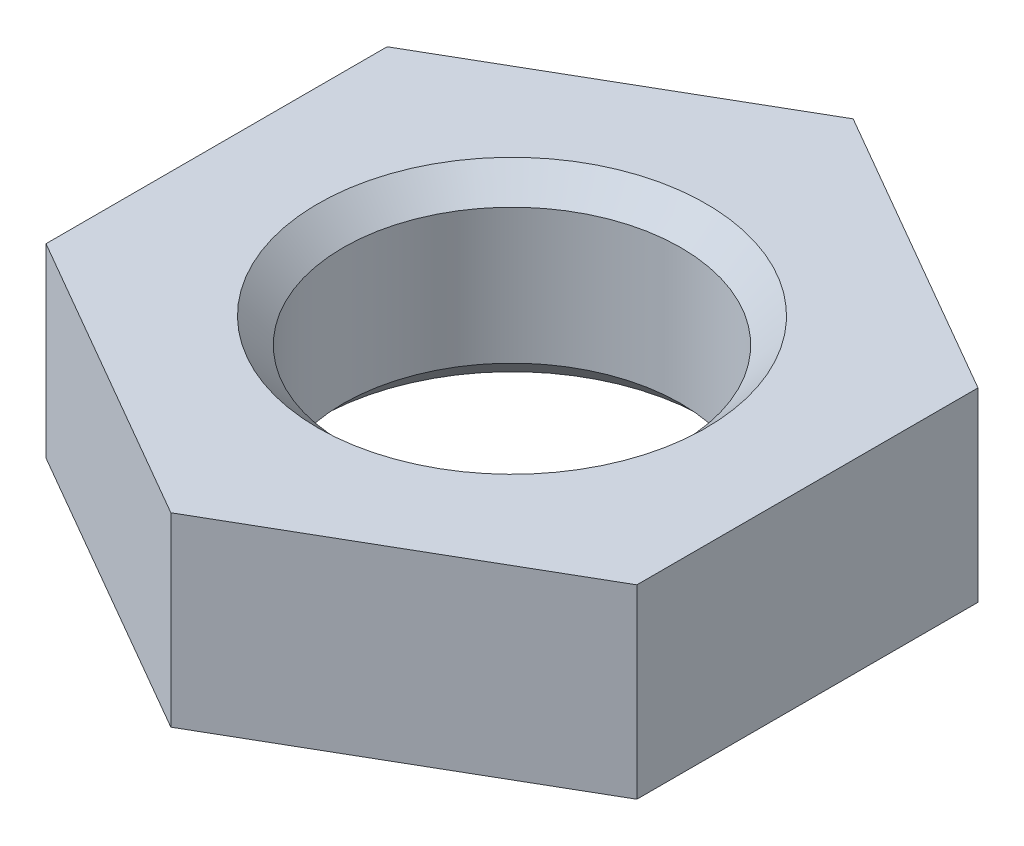
ISO-10303-21;
HEADER;
FILE_DESCRIPTION(('STEP AP214'),'2;1');
FILE_NAME('part.step','',(''),(''),'','','');
FILE_SCHEMA(('AUTOMOTIVE_DESIGN { 1 0 10303 214 1 1 1 1 }'));
ENDSEC;
DATA;
#1=APPLICATION_CONTEXT('core data for automotive mechanical design processes');
#2=APPLICATION_PROTOCOL_DEFINITION('international standard','automotive_design',2000,#1);
#3=PRODUCT_CONTEXT('',#1,'mechanical');
#4=PRODUCT('Part','Part','',(#3));
#5=PRODUCT_RELATED_PRODUCT_CATEGORY('part','',(#4));
#6=PRODUCT_DEFINITION_FORMATION('','',#4);
#7=PRODUCT_DEFINITION_CONTEXT('part definition',#1,'design');
#8=PRODUCT_DEFINITION('design','',#6,#7);
#9=PRODUCT_DEFINITION_SHAPE('','',#8);
#10=(LENGTH_UNIT() NAMED_UNIT(*) SI_UNIT(.MILLI.,.METRE.));
#11=(NAMED_UNIT(*) PLANE_ANGLE_UNIT() SI_UNIT($,.RADIAN.));
#12=(NAMED_UNIT(*) SI_UNIT($,.STERADIAN.) SOLID_ANGLE_UNIT());
#13=UNCERTAINTY_MEASURE_WITH_UNIT(LENGTH_MEASURE(1.E-05),#10,'distance_accuracy_value','');
#14=(GEOMETRIC_REPRESENTATION_CONTEXT(3) GLOBAL_UNCERTAINTY_ASSIGNED_CONTEXT((#13)) GLOBAL_UNIT_ASSIGNED_CONTEXT((#10,
#11,#12)) REPRESENTATION_CONTEXT('',''));
#15=CARTESIAN_POINT('',(0.,0.,0.));
#16=DIRECTION('',(0.,0.,1.));
#17=DIRECTION('',(1.,0.,0.));
#18=AXIS2_PLACEMENT_3D('',#15,#16,#17);
#19=CARTESIAN_POINT('',(0.,2.2,0.));
#20=DIRECTION('',(0.,1.,0.));
#21=DIRECTION('',(0.,0.,1.));
#22=AXIS2_PLACEMENT_3D('',#19,#20,#21);
#23=PLANE('',#22);
#24=CARTESIAN_POINT('',(0.,2.2,0.));
#25=DIRECTION('',(0.,1.,0.));
#26=DIRECTION('',(0.,0.,1.));
#27=AXIS2_PLACEMENT_3D('',#24,#25,#26);
#28=CIRCLE('',#27,2.3);
#29=CARTESIAN_POINT('',(0.,2.2,2.3));
#30=VERTEX_POINT('',#29);
#31=EDGE_CURVE('E11',#30,#30,#28,.F.);
#32=ORIENTED_EDGE('',*,*,#31,.T.);
#33=EDGE_LOOP('',(#32));
#34=FACE_BOUND('',#33,.T.);
#35=DIRECTION('',(-0.866025403784436,0.,0.500000000000004));
#36=VECTOR('',#35,1.);
#37=CARTESIAN_POINT('',(0.,2.2,-4.04145188432738));
#38=LINE('',#37,#36);
#39=CARTESIAN_POINT('',(0.,2.2,-4.04145188432738));
#40=VERTEX_POINT('',#39);
#41=CARTESIAN_POINT('',(-3.50000000000001,2.2,-2.02072594216367));
#42=VERTEX_POINT('',#41);
#43=EDGE_CURVE('E129',#40,#42,#38,.T.);
#44=ORIENTED_EDGE('',*,*,#43,.T.);
#45=DIRECTION('',(0.,0.,1.));
#46=VECTOR('',#45,1.);
#47=CARTESIAN_POINT('',(-3.50000000000001,2.2,-2.02072594216367));
#48=LINE('',#47,#46);
#49=CARTESIAN_POINT('',(-3.49999999999999,2.2,2.02072594216371));
#50=VERTEX_POINT('',#49);
#51=EDGE_CURVE('E89',#42,#50,#48,.T.);
#52=ORIENTED_EDGE('',*,*,#51,.T.);
#53=DIRECTION('',(0.866025403784441,0.,0.499999999999996));
#54=VECTOR('',#53,1.);
#55=CARTESIAN_POINT('',(-3.49999999999999,2.2,2.02072594216371));
#56=LINE('',#55,#54);
#57=CARTESIAN_POINT('',(0.,2.2,4.04145188432738));
#58=VERTEX_POINT('',#57);
#59=EDGE_CURVE('E101',#50,#58,#56,.T.);
#60=ORIENTED_EDGE('',*,*,#59,.T.);
#61=DIRECTION('',(0.866025403784436,0.,-0.500000000000004));
#62=VECTOR('',#61,1.);
#63=CARTESIAN_POINT('',(0.,2.2,4.04145188432738));
#64=LINE('',#63,#62);
#65=CARTESIAN_POINT('',(3.5,2.2,2.02072594216368));
#66=VERTEX_POINT('',#65);
#67=EDGE_CURVE('E96',#58,#66,#64,.T.);
#68=ORIENTED_EDGE('',*,*,#67,.T.);
#69=DIRECTION('',(0.,0.,-1.));
#70=VECTOR('',#69,1.);
#71=CARTESIAN_POINT('',(3.5,2.2,2.02072594216368));
#72=LINE('',#71,#70);
#73=CARTESIAN_POINT('',(3.49999999999999,2.2,-2.02072594216371));
#74=VERTEX_POINT('',#73);
#75=EDGE_CURVE('E99',#66,#74,#72,.T.);
#76=ORIENTED_EDGE('',*,*,#75,.T.);
#77=DIRECTION('',(-0.866025403784441,0.,-0.499999999999996));
#78=VECTOR('',#77,1.);
#79=CARTESIAN_POINT('',(3.49999999999999,2.2,-2.02072594216371));
#80=LINE('',#79,#78);
#81=EDGE_CURVE('E51',#74,#40,#80,.T.);
#82=ORIENTED_EDGE('',*,*,#81,.T.);
#83=EDGE_LOOP('',(#44,#52,#60,#68,#76,#82));
#84=FACE_BOUND('',#83,.T.);
#85=ADVANCED_FACE('F34',(#34,#84),#23,.T.);
#86=CARTESIAN_POINT('',(0.,0.,0.));
#87=DIRECTION('',(0.,1.,0.));
#88=DIRECTION('',(0.,0.,1.));
#89=AXIS2_PLACEMENT_3D('',#86,#87,#88);
#90=PLANE('',#89);
#91=CARTESIAN_POINT('',(0.,0.,0.));
#92=DIRECTION('',(0.,1.,0.));
#93=DIRECTION('',(0.,0.,1.));
#94=AXIS2_PLACEMENT_3D('',#91,#92,#93);
#95=CIRCLE('',#94,2.3);
#96=CARTESIAN_POINT('',(0.,0.,2.3));
#97=VERTEX_POINT('',#96);
#98=EDGE_CURVE('E138',#97,#97,#95,.T.);
#99=ORIENTED_EDGE('',*,*,#98,.T.);
#100=EDGE_LOOP('',(#99));
#101=FACE_BOUND('',#100,.T.);
#102=DIRECTION('',(-0.866025403784436,0.,0.500000000000004));
#103=VECTOR('',#102,1.);
#104=CARTESIAN_POINT('',(0.,0.,-4.04145188432738));
#105=LINE('',#104,#103);
#106=CARTESIAN_POINT('',(0.,0.,-4.04145188432738));
#107=VERTEX_POINT('',#106);
#108=CARTESIAN_POINT('',(-3.50000000000001,0.,-2.02072594216367));
#109=VERTEX_POINT('',#108);
#110=EDGE_CURVE('E119',#107,#109,#105,.T.);
#111=ORIENTED_EDGE('',*,*,#110,.F.);
#112=DIRECTION('',(-0.866025403784441,0.,-0.499999999999996));
#113=VECTOR('',#112,1.);
#114=CARTESIAN_POINT('',(3.49999999999999,0.,-2.02072594216371));
#115=LINE('',#114,#113);
#116=CARTESIAN_POINT('',(3.49999999999999,0.,-2.02072594216371));
#117=VERTEX_POINT('',#116);
#118=EDGE_CURVE('E80',#117,#107,#115,.T.);
#119=ORIENTED_EDGE('',*,*,#118,.F.);
#120=DIRECTION('',(0.,0.,-1.));
#121=VECTOR('',#120,1.);
#122=CARTESIAN_POINT('',(3.5,0.,2.02072594216368));
#123=LINE('',#122,#121);
#124=CARTESIAN_POINT('',(3.5,0.,2.02072594216368));
#125=VERTEX_POINT('',#124);
#126=EDGE_CURVE('E74',#125,#117,#123,.T.);
#127=ORIENTED_EDGE('',*,*,#126,.F.);
#128=DIRECTION('',(0.866025403784436,0.,-0.500000000000004));
#129=VECTOR('',#128,1.);
#130=CARTESIAN_POINT('',(0.,0.,4.04145188432738));
#131=LINE('',#130,#129);
#132=CARTESIAN_POINT('',(0.,0.,4.04145188432738));
#133=VERTEX_POINT('',#132);
#134=EDGE_CURVE('E109',#133,#125,#131,.T.);
#135=ORIENTED_EDGE('',*,*,#134,.F.);
#136=DIRECTION('',(0.866025403784441,0.,0.499999999999996));
#137=VECTOR('',#136,1.);
#138=CARTESIAN_POINT('',(-3.49999999999999,0.,2.02072594216371));
#139=LINE('',#138,#137);
#140=CARTESIAN_POINT('',(-3.49999999999999,0.,2.02072594216371));
#141=VERTEX_POINT('',#140);
#142=EDGE_CURVE('E124',#141,#133,#139,.T.);
#143=ORIENTED_EDGE('',*,*,#142,.F.);
#144=DIRECTION('',(0.,0.,1.));
#145=VECTOR('',#144,1.);
#146=CARTESIAN_POINT('',(-3.50000000000001,0.,-2.02072594216367));
#147=LINE('',#146,#145);
#148=EDGE_CURVE('E122',#109,#141,#147,.T.);
#149=ORIENTED_EDGE('',*,*,#148,.F.);
#150=EDGE_LOOP('',(#111,#119,#127,#135,#143,#149));
#151=FACE_BOUND('',#150,.T.);
#152=ADVANCED_FACE('F154',(#101,#151),#90,.F.);
#153=CARTESIAN_POINT('',(0.,2.2,-4.04145188432738));
#154=DIRECTION('',(0.500000000000004,0.,0.866025403784436));
#155=DIRECTION('',(0.866025403784436,0.,-0.500000000000004));
#156=AXIS2_PLACEMENT_3D('',#153,#154,#155);
#157=PLANE('',#156);
#158=ORIENTED_EDGE('',*,*,#110,.T.);
#159=DIRECTION('',(0.,-1.,0.));
#160=VECTOR('',#159,1.);
#161=CARTESIAN_POINT('',(-3.50000000000001,2.2,-2.02072594216367));
#162=LINE('',#161,#160);
#163=EDGE_CURVE('E136',#42,#109,#162,.T.);
#164=ORIENTED_EDGE('',*,*,#163,.F.);
#165=ORIENTED_EDGE('',*,*,#43,.F.);
#166=DIRECTION('',(0.,-1.,0.));
#167=VECTOR('',#166,1.);
#168=CARTESIAN_POINT('',(0.,2.2,-4.04145188432738));
#169=LINE('',#168,#167);
#170=EDGE_CURVE('E115',#40,#107,#169,.T.);
#171=ORIENTED_EDGE('',*,*,#170,.T.);
#172=EDGE_LOOP('',(#158,#164,#165,#171));
#173=FACE_BOUND('',#172,.T.);
#174=ADVANCED_FACE('F157',(#173),#157,.F.);
#175=CARTESIAN_POINT('',(-3.50000000000001,2.2,-2.02072594216367));
#176=DIRECTION('',(1.,0.,0.));
#177=DIRECTION('',(0.,0.,-1.));
#178=AXIS2_PLACEMENT_3D('',#175,#176,#177);
#179=PLANE('',#178);
#180=ORIENTED_EDGE('',*,*,#148,.T.);
#181=DIRECTION('',(0.,-1.,0.));
#182=VECTOR('',#181,1.);
#183=CARTESIAN_POINT('',(-3.49999999999999,2.2,2.02072594216371));
#184=LINE('',#183,#182);
#185=EDGE_CURVE('E133',#50,#141,#184,.T.);
#186=ORIENTED_EDGE('',*,*,#185,.F.);
#187=ORIENTED_EDGE('',*,*,#51,.F.);
#188=ORIENTED_EDGE('',*,*,#163,.T.);
#189=EDGE_LOOP('',(#180,#186,#187,#188));
#190=FACE_BOUND('',#189,.T.);
#191=ADVANCED_FACE('F233',(#190),#179,.F.);
#192=CARTESIAN_POINT('',(-3.49999999999999,2.2,2.02072594216371));
#193=DIRECTION('',(0.499999999999996,0.,-0.866025403784441));
#194=DIRECTION('',(-0.866025403784441,0.,-0.499999999999996));
#195=AXIS2_PLACEMENT_3D('',#192,#193,#194);
#196=PLANE('',#195);
#197=ORIENTED_EDGE('',*,*,#142,.T.);
#198=DIRECTION('',(0.,-1.,0.));
#199=VECTOR('',#198,1.);
#200=CARTESIAN_POINT('',(0.,2.2,4.04145188432738));
#201=LINE('',#200,#199);
#202=EDGE_CURVE('E110',#58,#133,#201,.T.);
#203=ORIENTED_EDGE('',*,*,#202,.F.);
#204=ORIENTED_EDGE('',*,*,#59,.F.);
#205=ORIENTED_EDGE('',*,*,#185,.T.);
#206=EDGE_LOOP('',(#197,#203,#204,#205));
#207=FACE_BOUND('',#206,.T.);
#208=ADVANCED_FACE('F224',(#207),#196,.F.);
#209=CARTESIAN_POINT('',(0.,2.2,4.04145188432738));
#210=DIRECTION('',(-0.500000000000004,0.,-0.866025403784436));
#211=DIRECTION('',(-0.866025403784436,0.,0.500000000000004));
#212=AXIS2_PLACEMENT_3D('',#209,#210,#211);
#213=PLANE('',#212);
#214=ORIENTED_EDGE('',*,*,#134,.T.);
#215=DIRECTION('',(0.,-1.,0.));
#216=VECTOR('',#215,1.);
#217=CARTESIAN_POINT('',(3.5,2.2,2.02072594216368));
#218=LINE('',#217,#216);
#219=EDGE_CURVE('E106',#66,#125,#218,.T.);
#220=ORIENTED_EDGE('',*,*,#219,.F.);
#221=ORIENTED_EDGE('',*,*,#67,.F.);
#222=ORIENTED_EDGE('',*,*,#202,.T.);
#223=EDGE_LOOP('',(#214,#220,#221,#222));
#224=FACE_BOUND('',#223,.T.);
#225=ADVANCED_FACE('F107',(#224),#213,.F.);
#226=CARTESIAN_POINT('',(3.5,2.2,2.02072594216368));
#227=DIRECTION('',(-1.,0.,0.));
#228=DIRECTION('',(0.,0.,1.));
#229=AXIS2_PLACEMENT_3D('',#226,#227,#228);
#230=PLANE('',#229);
#231=ORIENTED_EDGE('',*,*,#126,.T.);
#232=DIRECTION('',(0.,-1.,0.));
#233=VECTOR('',#232,1.);
#234=CARTESIAN_POINT('',(3.49999999999999,2.2,-2.02072594216371));
#235=LINE('',#234,#233);
#236=EDGE_CURVE('E111',#74,#117,#235,.T.);
#237=ORIENTED_EDGE('',*,*,#236,.F.);
#238=ORIENTED_EDGE('',*,*,#75,.F.);
#239=ORIENTED_EDGE('',*,*,#219,.T.);
#240=EDGE_LOOP('',(#231,#237,#238,#239));
#241=FACE_BOUND('',#240,.T.);
#242=ADVANCED_FACE('F113',(#241),#230,.F.);
#243=CARTESIAN_POINT('',(3.49999999999999,2.2,-2.02072594216371));
#244=DIRECTION('',(-0.499999999999996,0.,0.866025403784441));
#245=DIRECTION('',(0.866025403784441,0.,0.499999999999996));
#246=AXIS2_PLACEMENT_3D('',#243,#244,#245);
#247=PLANE('',#246);
#248=ORIENTED_EDGE('',*,*,#118,.T.);
#249=ORIENTED_EDGE('',*,*,#170,.F.);
#250=ORIENTED_EDGE('',*,*,#81,.F.);
#251=ORIENTED_EDGE('',*,*,#236,.T.);
#252=EDGE_LOOP('',(#248,#249,#250,#251));
#253=FACE_BOUND('',#252,.T.);
#254=ADVANCED_FACE('F164',(#253),#247,.F.);
#255=CARTESIAN_POINT('',(0.,2.2,0.));
#256=DIRECTION('',(0.,-1.,0.));
#257=DIRECTION('',(0.,0.,-1.));
#258=AXIS2_PLACEMENT_3D('',#255,#256,#257);
#259=CYLINDRICAL_SURFACE('',#258,2.);
#260=CARTESIAN_POINT('',(0.,0.3,0.));
#261=DIRECTION('',(0.,1.,0.));
#262=DIRECTION('',(0.,0.,1.));
#263=AXIS2_PLACEMENT_3D('',#260,#261,#262);
#264=CIRCLE('',#263,2.);
#265=CARTESIAN_POINT('',(0.,0.3,2.));
#266=VERTEX_POINT('',#265);
#267=EDGE_CURVE('E43',#266,#266,#264,.F.);
#268=ORIENTED_EDGE('',*,*,#267,.T.);
#269=EDGE_LOOP('',(#268));
#270=FACE_BOUND('',#269,.T.);
#271=CARTESIAN_POINT('',(0.,1.9,0.));
#272=DIRECTION('',(0.,1.,0.));
#273=DIRECTION('',(0.,0.,1.));
#274=AXIS2_PLACEMENT_3D('',#271,#272,#273);
#275=CIRCLE('',#274,2.);
#276=CARTESIAN_POINT('',(0.,1.9,2.));
#277=VERTEX_POINT('',#276);
#278=EDGE_CURVE('E141',#277,#277,#275,.T.);
#279=ORIENTED_EDGE('',*,*,#278,.T.);
#280=EDGE_LOOP('',(#279));
#281=FACE_BOUND('',#280,.T.);
#282=ADVANCED_FACE('F146',(#270,#281),#259,.F.);
#283=CARTESIAN_POINT('',(0.,0.,0.));
#284=DIRECTION('',(0.,-1.,0.));
#285=DIRECTION('',(0.,0.,-1.));
#286=AXIS2_PLACEMENT_3D('',#283,#284,#285);
#287=CONICAL_SURFACE('',#286,2.3,0.785398163397448);
#288=ORIENTED_EDGE('',*,*,#267,.F.);
#289=EDGE_LOOP('',(#288));
#290=FACE_BOUND('',#289,.T.);
#291=ORIENTED_EDGE('',*,*,#98,.F.);
#292=EDGE_LOOP('',(#291));
#293=FACE_BOUND('',#292,.T.);
#294=ADVANCED_FACE('F149',(#290,#293),#287,.F.);
#295=CARTESIAN_POINT('',(0.,1.9,0.));
#296=DIRECTION('',(0.,1.,0.));
#297=DIRECTION('',(0.,0.,1.));
#298=AXIS2_PLACEMENT_3D('',#295,#296,#297);
#299=CONICAL_SURFACE('',#298,2.,0.78539816339745);
#300=ORIENTED_EDGE('',*,*,#31,.F.);
#301=EDGE_LOOP('',(#300));
#302=FACE_BOUND('',#301,.T.);
#303=ORIENTED_EDGE('',*,*,#278,.F.);
#304=EDGE_LOOP('',(#303));
#305=FACE_BOUND('',#304,.T.);
#306=ADVANCED_FACE('F36',(#302,#305),#299,.F.);
#307=CLOSED_SHELL('',(#85,#152,#174,#191,#208,#225,#242,#254,#282,#294,#306));
#308=MANIFOLD_SOLID_BREP('B2',#307);
#309=ADVANCED_BREP_SHAPE_REPRESENTATION('',(#18,#308),#14);
#310=SHAPE_DEFINITION_REPRESENTATION(#9,#309);
ENDSEC;
END-ISO-10303-21;
